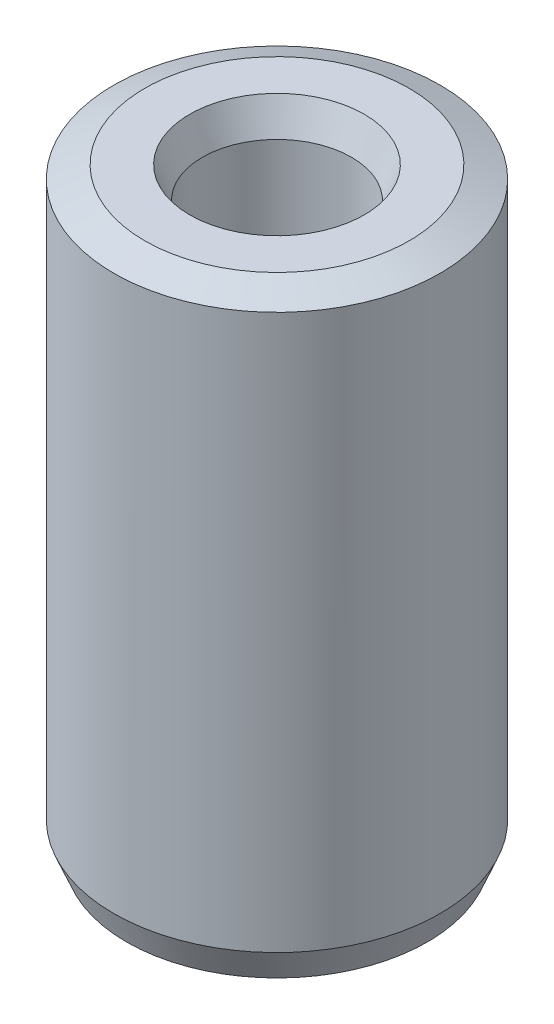
ISO-10303-21;
HEADER;
FILE_DESCRIPTION(('STEP AP214'),'2;1');
FILE_NAME('part.step','',(''),(''),'','','');
FILE_SCHEMA(('AUTOMOTIVE_DESIGN { 1 0 10303 214 1 1 1 1 }'));
ENDSEC;
DATA;
#1=APPLICATION_CONTEXT('core data for automotive mechanical design processes');
#2=APPLICATION_PROTOCOL_DEFINITION('international standard','automotive_design',2000,#1);
#3=PRODUCT_CONTEXT('',#1,'mechanical');
#4=PRODUCT('Part','Part','',(#3));
#5=PRODUCT_RELATED_PRODUCT_CATEGORY('part','',(#4));
#6=PRODUCT_DEFINITION_FORMATION('','',#4);
#7=PRODUCT_DEFINITION_CONTEXT('part definition',#1,'design');
#8=PRODUCT_DEFINITION('design','',#6,#7);
#9=PRODUCT_DEFINITION_SHAPE('','',#8);
#10=(LENGTH_UNIT() NAMED_UNIT(*) SI_UNIT(.MILLI.,.METRE.));
#11=(NAMED_UNIT(*) PLANE_ANGLE_UNIT() SI_UNIT($,.RADIAN.));
#12=(NAMED_UNIT(*) SI_UNIT($,.STERADIAN.) SOLID_ANGLE_UNIT());
#13=UNCERTAINTY_MEASURE_WITH_UNIT(LENGTH_MEASURE(1.E-05),#10,'distance_accuracy_value','');
#14=(GEOMETRIC_REPRESENTATION_CONTEXT(3) GLOBAL_UNCERTAINTY_ASSIGNED_CONTEXT((#13)) GLOBAL_UNIT_ASSIGNED_CONTEXT((#10,
#11,#12)) REPRESENTATION_CONTEXT('',''));
#15=CARTESIAN_POINT('',(0.,0.,0.));
#16=DIRECTION('',(0.,0.,1.));
#17=DIRECTION('',(1.,0.,0.));
#18=AXIS2_PLACEMENT_3D('',#15,#16,#17);
#19=CARTESIAN_POINT('',(0.,183.324099760065,0.));
#20=DIRECTION('',(0.,-1.,0.));
#21=DIRECTION('',(0.,0.,-1.));
#22=AXIS2_PLACEMENT_3D('',#19,#20,#21);
#23=CYLINDRICAL_SURFACE('',#22,50.);
#24=CARTESIAN_POINT('',(0.,9.48601579680206,0.));
#25=DIRECTION('',(0.,1.,0.));
#26=DIRECTION('',(0.,0.,1.));
#27=AXIS2_PLACEMENT_3D('',#24,#25,#26);
#28=CIRCLE('',#27,50.);
#29=CARTESIAN_POINT('',(0.,9.48601579680206,-50.));
#30=VERTEX_POINT('',#29);
#31=EDGE_CURVE('E10',#30,#30,#28,.T.);
#32=CARTESIAN_POINT('',(0.,179.442216912699,0.));
#33=DIRECTION('',(0.,1.,0.));
#34=DIRECTION('',(0.,0.,1.));
#35=AXIS2_PLACEMENT_3D('',#32,#33,#34);
#36=CIRCLE('',#35,50.);
#37=CARTESIAN_POINT('',(0.,179.442216912699,-50.));
#38=VERTEX_POINT('',#37);
#39=EDGE_CURVE('E50',#38,#38,#36,.F.);
#40=CARTESIAN_POINT('',(0.,9.48601579680206,-50.));
#41=CARTESIAN_POINT('',(0.,11.2563928917593,-50.));
#42=CARTESIAN_POINT('',(0.,13.0267699867166,-50.));
#43=CARTESIAN_POINT('',(0.,16.5675241766311,-50.));
#44=CARTESIAN_POINT('',(0.,18.3379012715884,-50.));
#45=CARTESIAN_POINT('',(0.,21.8786554615029,-50.));
#46=CARTESIAN_POINT('',(0.,23.6490325564601,-50.));
#47=CARTESIAN_POINT('',(0.,27.1897867463747,-50.));
#48=CARTESIAN_POINT('',(0.,28.9601638413319,-50.));
#49=CARTESIAN_POINT('',(0.,32.5009180312464,-50.));
#50=CARTESIAN_POINT('',(0.,34.2712951262037,-50.));
#51=CARTESIAN_POINT('',(0.,37.8120493161182,-50.));
#52=CARTESIAN_POINT('',(0.,39.5824264110755,-50.));
#53=CARTESIAN_POINT('',(0.,43.12318060099,-50.));
#54=CARTESIAN_POINT('',(0.,44.8935576959473,-50.));
#55=CARTESIAN_POINT('',(0.,48.4343118858618,-50.));
#56=CARTESIAN_POINT('',(0.,50.2046889808191,-50.));
#57=CARTESIAN_POINT('',(0.,53.7454431707336,-50.));
#58=CARTESIAN_POINT('',(0.,55.5158202656908,-50.));
#59=CARTESIAN_POINT('',(0.,59.0565744556054,-50.));
#60=CARTESIAN_POINT('',(0.,60.8269515505626,-50.));
#61=CARTESIAN_POINT('',(0.,64.3677057404771,-50.));
#62=CARTESIAN_POINT('',(0.,66.1380828354344,-50.));
#63=CARTESIAN_POINT('',(0.,69.6788370253489,-50.));
#64=CARTESIAN_POINT('',(0.,71.4492141203062,-50.));
#65=CARTESIAN_POINT('',(0.,74.9899683102207,-50.));
#66=CARTESIAN_POINT('',(0.,76.760345405178,-50.));
#67=CARTESIAN_POINT('',(0.,80.3010995950925,-50.));
#68=CARTESIAN_POINT('',(0.,82.0714766900498,-50.));
#69=CARTESIAN_POINT('',(0.,85.6122308799643,-50.));
#70=CARTESIAN_POINT('',(0.,87.3826079749215,-50.));
#71=CARTESIAN_POINT('',(0.,90.9233621648361,-50.));
#72=CARTESIAN_POINT('',(0.,92.6937392597933,-50.));
#73=CARTESIAN_POINT('',(0.,96.2344934497079,-50.));
#74=CARTESIAN_POINT('',(0.,98.0048705446651,-50.));
#75=CARTESIAN_POINT('',(0.,101.54562473458,-50.));
#76=CARTESIAN_POINT('',(0.,103.316001829537,-50.));
#77=CARTESIAN_POINT('',(0.,106.856756019451,-50.));
#78=CARTESIAN_POINT('',(0.,108.627133114409,-50.));
#79=CARTESIAN_POINT('',(0.,112.167887304323,-50.));
#80=CARTESIAN_POINT('',(0.,113.93826439928,-50.));
#81=CARTESIAN_POINT('',(0.,117.479018589195,-50.));
#82=CARTESIAN_POINT('',(0.,119.249395684152,-50.));
#83=CARTESIAN_POINT('',(0.,122.790149874067,-50.));
#84=CARTESIAN_POINT('',(0.,124.560526969024,-50.));
#85=CARTESIAN_POINT('',(0.,128.101281158939,-50.));
#86=CARTESIAN_POINT('',(0.,129.871658253896,-50.));
#87=CARTESIAN_POINT('',(0.,133.41241244381,-50.));
#88=CARTESIAN_POINT('',(0.,135.182789538768,-50.));
#89=CARTESIAN_POINT('',(0.,138.723543728682,-50.));
#90=CARTESIAN_POINT('',(0.,140.493920823639,-50.));
#91=CARTESIAN_POINT('',(0.,144.034675013554,-50.));
#92=CARTESIAN_POINT('',(0.,145.805052108511,-50.));
#93=CARTESIAN_POINT('',(0.,149.345806298426,-50.));
#94=CARTESIAN_POINT('',(0.,151.116183393383,-50.));
#95=CARTESIAN_POINT('',(0.,154.656937583297,-50.));
#96=CARTESIAN_POINT('',(0.,156.427314678255,-50.));
#97=CARTESIAN_POINT('',(0.,159.968068868169,-50.));
#98=CARTESIAN_POINT('',(0.,161.738445963127,-50.));
#99=CARTESIAN_POINT('',(0.,165.279200153041,-50.));
#100=CARTESIAN_POINT('',(0.,167.049577247998,-50.));
#101=CARTESIAN_POINT('',(0.,170.590331437913,-50.));
#102=CARTESIAN_POINT('',(0.,172.36070853287,-50.));
#103=CARTESIAN_POINT('',(0.,175.901462722785,-50.));
#104=CARTESIAN_POINT('',(0.,177.671839817742,-50.));
#105=CARTESIAN_POINT('',(0.,179.442216912699,-50.));
#106=B_SPLINE_CURVE_WITH_KNOTS('',3,(#40,#41,#42,#43,#44,#45,#46,#47,#48,#49,#50,#51,#52,#53,
#54,#55,#56,#57,#58,#59,#60,#61,#62,#63,#64,#65,#66,#67,#68,#69,#70,#71,#72,#73,#74,#75,#76,#77,
#78,#79,#80,#81,#82,#83,#84,#85,#86,#87,#88,#89,#90,#91,#92,#93,#94,#95,#96,#97,#98,#99,#100,
#101,#102,#103,#104,#105),.UNSPECIFIED.,.F.,.F.,(4,2,2,2,2,2,2,2,2,2,2,2,2,2,2,2,2,2,2,2,2,2,2,
2,2,2,2,2,2,2,2,2,4),(0.,5.31113128487179,10.6222625697436,15.9333938546153,21.2445251394871,
26.5556564243589,31.8667877092307,37.1779189941025,42.4890502789743,47.8001815638461,
53.1113128487178,58.4224441335896,63.7335754184614,69.0447067033332,74.355837988205,
79.6669692730767,84.9781005579485,90.2892318428203,95.6003631276921,100.911494412564,
106.222625697436,111.533756982307,116.844888267179,122.156019552051,127.467150836923,
132.778282121795,138.089413406666,143.400544691538,148.71167597641,154.022807261282,
159.333938546153,164.645069831025,169.956201115897),.UNSPECIFIED.);
#107=EDGE_CURVE('BSEAM39',#30,#38,#106,.T.);
#108=ORIENTED_EDGE('',*,*,#31,.T.);
#109=ORIENTED_EDGE('',*,*,#39,.T.);
#110=ORIENTED_EDGE('',*,*,#107,.T.);
#111=ORIENTED_EDGE('',*,*,#107,.F.);
#112=EDGE_LOOP('',(#108,#110,#109,#111));
#113=FACE_BOUND('',#112,.T.);
#114=ADVANCED_FACE('F39',(#113),#23,.T.);
#115=CARTESIAN_POINT('',(0.,183.324099760065,0.));
#116=DIRECTION('',(0.,1.,0.));
#117=DIRECTION('',(0.,0.,1.));
#118=AXIS2_PLACEMENT_3D('',#115,#116,#117);
#119=PLANE('',#118);
#120=CARTESIAN_POINT('',(0.,183.324099760065,0.));
#121=DIRECTION('',(0.,1.,0.));
#122=DIRECTION('',(0.,0.,1.));
#123=AXIS2_PLACEMENT_3D('',#120,#121,#122);
#124=CIRCLE('',#123,26.7447267828788);
#125=CARTESIAN_POINT('',(0.,183.324099760065,26.7447267828788));
#126=VERTEX_POINT('',#125);
#127=EDGE_CURVE('E58',#126,#126,#124,.F.);
#128=ORIENTED_EDGE('',*,*,#127,.T.);
#129=EDGE_LOOP('',(#128));
#130=FACE_BOUND('',#129,.T.);
#131=CARTESIAN_POINT('',(0.,183.324099760065,0.));
#132=DIRECTION('',(0.,1.,0.));
#133=DIRECTION('',(0.,0.,1.));
#134=AXIS2_PLACEMENT_3D('',#131,#132,#133);
#135=CIRCLE('',#134,40.5139842031986);
#136=CARTESIAN_POINT('',(0.,183.324099760065,-40.5139842031987));
#137=VERTEX_POINT('',#136);
#138=EDGE_CURVE('E61',#137,#137,#135,.T.);
#139=ORIENTED_EDGE('',*,*,#138,.T.);
#140=EDGE_LOOP('',(#139));
#141=FACE_BOUND('',#140,.T.);
#142=ADVANCED_FACE('F88',(#130,#141),#119,.T.);
#143=CARTESIAN_POINT('',(0.,0.,0.));
#144=DIRECTION('',(0.,1.,0.));
#145=DIRECTION('',(0.,0.,1.));
#146=AXIS2_PLACEMENT_3D('',#143,#144,#145);
#147=PLANE('',#146);
#148=CARTESIAN_POINT('',(0.,0.,0.));
#149=DIRECTION('',(0.,1.,0.));
#150=DIRECTION('',(0.,0.,1.));
#151=AXIS2_PLACEMENT_3D('',#148,#149,#150);
#152=CIRCLE('',#151,32.3488597323145);
#153=CARTESIAN_POINT('',(0.,0.,32.3488597323145));
#154=VERTEX_POINT('',#153);
#155=EDGE_CURVE('E51',#154,#154,#152,.T.);
#156=ORIENTED_EDGE('',*,*,#155,.T.);
#157=EDGE_LOOP('',(#156));
#158=FACE_BOUND('',#157,.T.);
#159=CARTESIAN_POINT('',(0.,0.,0.));
#160=DIRECTION('',(0.,1.,0.));
#161=DIRECTION('',(0.,0.,1.));
#162=AXIS2_PLACEMENT_3D('',#159,#160,#161);
#163=CIRCLE('',#162,46.1181171526343);
#164=CARTESIAN_POINT('',(0.,0.,46.1181171526343));
#165=VERTEX_POINT('',#164);
#166=EDGE_CURVE('E54',#165,#165,#163,.F.);
#167=ORIENTED_EDGE('',*,*,#166,.T.);
#168=EDGE_LOOP('',(#167));
#169=FACE_BOUND('',#168,.T.);
#170=ADVANCED_FACE('F83',(#158,#169),#147,.F.);
#171=CARTESIAN_POINT('',(0.,183.324099760065,0.));
#172=DIRECTION('',(0.,-1.,0.));
#173=DIRECTION('',(0.,0.,-1.));
#174=AXIS2_PLACEMENT_3D('',#171,#172,#173);
#175=CYLINDRICAL_SURFACE('',#174,22.8628439355132);
#176=CARTESIAN_POINT('',(0.,173.838083963263,0.));
#177=DIRECTION('',(0.,1.,0.));
#178=DIRECTION('',(0.,0.,1.));
#179=AXIS2_PLACEMENT_3D('',#176,#177,#178);
#180=CIRCLE('',#179,22.8628439355132);
#181=CARTESIAN_POINT('',(0.,173.838083963263,-22.8628439355132));
#182=VERTEX_POINT('',#181);
#183=EDGE_CURVE('E67',#182,#182,#180,.T.);
#184=CARTESIAN_POINT('',(0.,3.8818828473654,0.));
#185=DIRECTION('',(0.,1.,0.));
#186=DIRECTION('',(0.,0.,1.));
#187=AXIS2_PLACEMENT_3D('',#184,#185,#186);
#188=CIRCLE('',#187,22.8628439355132);
#189=CARTESIAN_POINT('',(0.,3.88188284736538,-22.8628439355132));
#190=VERTEX_POINT('',#189);
#191=EDGE_CURVE('E69',#190,#190,#188,.F.);
#192=CARTESIAN_POINT('',(0.,173.838083963263,-22.8628439355132));
#193=CARTESIAN_POINT('',(0.,172.067706868306,-22.8628439355132));
#194=CARTESIAN_POINT('',(0.,170.297329773348,-22.8628439355132));
#195=CARTESIAN_POINT('',(0.,166.756575583434,-22.8628439355132));
#196=CARTESIAN_POINT('',(0.,164.986198488477,-22.8628439355132));
#197=CARTESIAN_POINT('',(0.,161.445444298562,-22.8628439355132));
#198=CARTESIAN_POINT('',(0.,159.675067203605,-22.8628439355132));
#199=CARTESIAN_POINT('',(0.,156.13431301369,-22.8628439355132));
#200=CARTESIAN_POINT('',(0.,154.363935918733,-22.8628439355132));
#201=CARTESIAN_POINT('',(0.,150.823181728818,-22.8628439355132));
#202=CARTESIAN_POINT('',(0.,149.052804633861,-22.8628439355132));
#203=CARTESIAN_POINT('',(0.,145.512050443947,-22.8628439355132));
#204=CARTESIAN_POINT('',(0.,143.741673348989,-22.8628439355132));
#205=CARTESIAN_POINT('',(0.,140.200919159075,-22.8628439355132));
#206=CARTESIAN_POINT('',(0.,138.430542064118,-22.8628439355132));
#207=CARTESIAN_POINT('',(0.,134.889787874203,-22.8628439355132));
#208=CARTESIAN_POINT('',(0.,133.119410779246,-22.8628439355132));
#209=CARTESIAN_POINT('',(0.,129.578656589331,-22.8628439355132));
#210=CARTESIAN_POINT('',(0.,127.808279494374,-22.8628439355132));
#211=CARTESIAN_POINT('',(0.,124.267525304459,-22.8628439355132));
#212=CARTESIAN_POINT('',(0.,122.497148209502,-22.8628439355132));
#213=CARTESIAN_POINT('',(0.,118.956394019588,-22.8628439355132));
#214=CARTESIAN_POINT('',(0.,117.18601692463,-22.8628439355132));
#215=CARTESIAN_POINT('',(0.,113.645262734716,-22.8628439355132));
#216=CARTESIAN_POINT('',(0.,111.874885639759,-22.8628439355132));
#217=CARTESIAN_POINT('',(0.,108.334131449844,-22.8628439355132));
#218=CARTESIAN_POINT('',(0.,106.563754354887,-22.8628439355132));
#219=CARTESIAN_POINT('',(0.,103.023000164972,-22.8628439355132));
#220=CARTESIAN_POINT('',(0.,101.252623070015,-22.8628439355132));
#221=CARTESIAN_POINT('',(0.,97.7118688801004,-22.8628439355132));
#222=CARTESIAN_POINT('',(0.,95.9414917851432,-22.8628439355132));
#223=CARTESIAN_POINT('',(0.,92.4007375952286,-22.8628439355132));
#224=CARTESIAN_POINT('',(0.,90.6303605002714,-22.8628439355132));
#225=CARTESIAN_POINT('',(0.,87.0896063103569,-22.8628439355132));
#226=CARTESIAN_POINT('',(0.,85.3192292153996,-22.8628439355132));
#227=CARTESIAN_POINT('',(0.,81.7784750254851,-22.8628439355132));
#228=CARTESIAN_POINT('',(0.,80.0080979305278,-22.8628439355132));
#229=CARTESIAN_POINT('',(0.,76.4673437406133,-22.8628439355132));
#230=CARTESIAN_POINT('',(0.,74.696966645656,-22.8628439355132));
#231=CARTESIAN_POINT('',(0.,71.1562124557415,-22.8628439355132));
#232=CARTESIAN_POINT('',(0.,69.3858353607842,-22.8628439355132));
#233=CARTESIAN_POINT('',(0.,65.8450811708697,-22.8628439355132));
#234=CARTESIAN_POINT('',(0.,64.0747040759124,-22.8628439355132));
#235=CARTESIAN_POINT('',(0.,60.5339498859979,-22.8628439355132));
#236=CARTESIAN_POINT('',(0.,58.7635727910406,-22.8628439355132));
#237=CARTESIAN_POINT('',(0.,55.2228186011261,-22.8628439355132));
#238=CARTESIAN_POINT('',(0.,53.4524415061688,-22.8628439355132));
#239=CARTESIAN_POINT('',(0.,49.9116873162543,-22.8628439355132));
#240=CARTESIAN_POINT('',(0.,48.141310221297,-22.8628439355132));
#241=CARTESIAN_POINT('',(0.,44.6005560313825,-22.8628439355132));
#242=CARTESIAN_POINT('',(0.,42.8301789364252,-22.8628439355132));
#243=CARTESIAN_POINT('',(0.,39.2894247465107,-22.8628439355132));
#244=CARTESIAN_POINT('',(0.,37.5190476515534,-22.8628439355132));
#245=CARTESIAN_POINT('',(0.,33.9782934616389,-22.8628439355132));
#246=CARTESIAN_POINT('',(0.,32.2079163666816,-22.8628439355132));
#247=CARTESIAN_POINT('',(0.,28.6671621767671,-22.8628439355132));
#248=CARTESIAN_POINT('',(0.,26.8967850818098,-22.8628439355132));
#249=CARTESIAN_POINT('',(0.,23.3560308918953,-22.8628439355132));
#250=CARTESIAN_POINT('',(0.,21.585653796938,-22.8628439355132));
#251=CARTESIAN_POINT('',(0.,18.0448996070235,-22.8628439355132));
#252=CARTESIAN_POINT('',(0.,16.2745225120662,-22.8628439355132));
#253=CARTESIAN_POINT('',(0.,12.7337683221517,-22.8628439355132));
#254=CARTESIAN_POINT('',(0.,10.9633912271944,-22.8628439355132));
#255=CARTESIAN_POINT('',(0.,7.42263703727992,-22.8628439355132));
#256=CARTESIAN_POINT('',(0.,5.65225994232265,-22.8628439355132));
#257=CARTESIAN_POINT('',(0.,3.88188284736538,-22.8628439355132));
#258=B_SPLINE_CURVE_WITH_KNOTS('',3,(#192,#193,#194,#195,#196,#197,#198,#199,#200,#201,#202,
#203,#204,#205,#206,#207,#208,#209,#210,#211,#212,#213,#214,#215,#216,#217,#218,#219,#220,#221,
#222,#223,#224,#225,#226,#227,#228,#229,#230,#231,#232,#233,#234,#235,#236,#237,#238,#239,#240,
#241,#242,#243,#244,#245,#246,#247,#248,#249,#250,#251,#252,#253,#254,#255,#256,#257),
.UNSPECIFIED.,.F.,.F.,(4,2,2,2,2,2,2,2,2,2,2,2,2,2,2,2,2,2,2,2,2,2,2,2,2,2,2,2,2,2,2,2,4),(0.,
5.31113128487182,10.6222625697436,15.9333938546154,21.2445251394872,26.555656424359,
31.8667877092308,37.1779189941026,42.4890502789744,47.8001815638462,53.111312848718,
58.4224441335898,63.7335754184616,69.0447067033333,74.3558379882052,79.666969273077,
84.9781005579487,90.2892318428205,95.6003631276923,100.911494412564,106.222625697436,
111.533756982308,116.84488826718,122.156019552051,127.467150836923,132.778282121795,
138.089413406667,143.400544691538,148.71167597641,154.022807261282,159.333938546154,
164.645069831026,169.956201115897),.UNSPECIFIED.);
#259=EDGE_CURVE('BSEAM71',#182,#190,#258,.T.);
#260=ORIENTED_EDGE('',*,*,#183,.T.);
#261=ORIENTED_EDGE('',*,*,#191,.T.);
#262=ORIENTED_EDGE('',*,*,#259,.T.);
#263=ORIENTED_EDGE('',*,*,#259,.F.);
#264=EDGE_LOOP('',(#260,#262,#261,#263));
#265=FACE_BOUND('',#264,.T.);
#266=ADVANCED_FACE('F71',(#265),#175,.F.);
#267=CARTESIAN_POINT('',(0.,173.838083963263,0.));
#268=DIRECTION('',(0.,1.,0.));
#269=DIRECTION('',(0.,0.,1.));
#270=AXIS2_PLACEMENT_3D('',#267,#268,#269);
#271=CONICAL_SURFACE('',#270,22.8628439355132,0.388430693503342);
#272=ORIENTED_EDGE('',*,*,#127,.F.);
#273=EDGE_LOOP('',(#272));
#274=FACE_BOUND('',#273,.T.);
#275=ORIENTED_EDGE('',*,*,#183,.F.);
#276=EDGE_LOOP('',(#275));
#277=FACE_BOUND('',#276,.T.);
#278=ADVANCED_FACE('F77',(#274,#277),#271,.F.);
#279=CARTESIAN_POINT('',(0.,0.,0.));
#280=DIRECTION('',(0.,-1.,0.));
#281=DIRECTION('',(0.,0.,-1.));
#282=AXIS2_PLACEMENT_3D('',#279,#280,#281);
#283=CONICAL_SURFACE('',#282,32.3488597323145,1.18236563329155);
#284=ORIENTED_EDGE('',*,*,#191,.F.);
#285=EDGE_LOOP('',(#284));
#286=FACE_BOUND('',#285,.T.);
#287=ORIENTED_EDGE('',*,*,#155,.F.);
#288=EDGE_LOOP('',(#287));
#289=FACE_BOUND('',#288,.T.);
#290=ADVANCED_FACE('F73',(#286,#289),#283,.F.);
#291=CARTESIAN_POINT('',(0.,9.48601579680203,0.));
#292=DIRECTION('',(0.,1.,0.));
#293=DIRECTION('',(0.,0.,1.));
#294=AXIS2_PLACEMENT_3D('',#291,#292,#293);
#295=CONICAL_SURFACE('',#294,50.,0.388430693503345);
#296=ORIENTED_EDGE('',*,*,#166,.F.);
#297=EDGE_LOOP('',(#296));
#298=FACE_BOUND('',#297,.T.);
#299=ORIENTED_EDGE('',*,*,#31,.F.);
#300=EDGE_LOOP('',(#299));
#301=FACE_BOUND('',#300,.T.);
#302=ADVANCED_FACE('F76',(#298,#301),#295,.T.);
#303=CARTESIAN_POINT('',(0.,183.324099760065,0.));
#304=DIRECTION('',(0.,-1.,0.));
#305=DIRECTION('',(0.,0.,-1.));
#306=AXIS2_PLACEMENT_3D('',#303,#304,#305);
#307=CONICAL_SURFACE('',#306,40.5139842031986,1.18236563329155);
#308=CARTESIAN_POINT('',(0.,179.442216912699,-50.));
#309=CARTESIAN_POINT('',(0.,179.482653192359,-49.90118733545));
#310=CARTESIAN_POINT('',(0.,179.523089472019,-49.8023746709));
#311=CARTESIAN_POINT('',(0.,179.603962031339,-49.6047493418));
#312=CARTESIAN_POINT('',(0.,179.644398310999,-49.50593667725));
#313=CARTESIAN_POINT('',(0.,179.72527087032,-49.3083113481499));
#314=CARTESIAN_POINT('',(0.,179.76570714998,-49.2094986835999));
#315=CARTESIAN_POINT('',(0.,179.8465797093,-49.0118733544999));
#316=CARTESIAN_POINT('',(0.,179.88701598896,-48.9130606899499));
#317=CARTESIAN_POINT('',(0.,179.96788854828,-48.7154353608499));
#318=CARTESIAN_POINT('',(0.,180.00832482794,-48.6166226962998));
#319=CARTESIAN_POINT('',(0.,180.08919738726,-48.4189973671998));
#320=CARTESIAN_POINT('',(0.,180.12963366692,-48.3201847026498));
#321=CARTESIAN_POINT('',(0.,180.21050622624,-48.1225593735498));
#322=CARTESIAN_POINT('',(0.,180.2509425059,-48.0237467089998));
#323=CARTESIAN_POINT('',(0.,180.33181506522,-47.8261213798997));
#324=CARTESIAN_POINT('',(0.,180.37225134488,-47.7273087153497));
#325=CARTESIAN_POINT('',(0.,180.453123904201,-47.5296833862497));
#326=CARTESIAN_POINT('',(0.,180.493560183861,-47.4308707216997));
#327=CARTESIAN_POINT('',(0.,180.574432743181,-47.2332453925996));
#328=CARTESIAN_POINT('',(0.,180.614869022841,-47.1344327280496));
#329=CARTESIAN_POINT('',(0.,180.695741582161,-46.9368073989496));
#330=CARTESIAN_POINT('',(0.,180.736177861821,-46.8379947343996));
#331=CARTESIAN_POINT('',(0.,180.817050421141,-46.6403694052996));
#332=CARTESIAN_POINT('',(0.,180.857486700801,-46.5415567407495));
#333=CARTESIAN_POINT('',(0.,180.938359260121,-46.3439314116495));
#334=CARTESIAN_POINT('',(0.,180.978795539781,-46.2451187470995));
#335=CARTESIAN_POINT('',(0.,181.059668099101,-46.0474934179995));
#336=CARTESIAN_POINT('',(0.,181.100104378761,-45.9486807534495));
#337=CARTESIAN_POINT('',(0.,181.180976938082,-45.7510554243494));
#338=CARTESIAN_POINT('',(0.,181.221413217742,-45.6522427597994));
#339=CARTESIAN_POINT('',(0.,181.302285777062,-45.4546174306994));
#340=CARTESIAN_POINT('',(0.,181.342722056722,-45.3558047661494));
#341=CARTESIAN_POINT('',(0.,181.423594616042,-45.1581794370493));
#342=CARTESIAN_POINT('',(0.,181.464030895702,-45.0593667724993));
#343=CARTESIAN_POINT('',(0.,181.544903455022,-44.8617414433993));
#344=CARTESIAN_POINT('',(0.,181.585339734682,-44.7629287788493));
#345=CARTESIAN_POINT('',(0.,181.666212294002,-44.5653034497493));
#346=CARTESIAN_POINT('',(0.,181.706648573662,-44.4664907851992));
#347=CARTESIAN_POINT('',(0.,181.787521132982,-44.2688654560992));
#348=CARTESIAN_POINT('',(0.,181.827957412642,-44.1700527915492));
#349=CARTESIAN_POINT('',(0.,181.908829971963,-43.9724274624492));
#350=CARTESIAN_POINT('',(0.,181.949266251623,-43.8736147978992));
#351=CARTESIAN_POINT('',(0.,182.030138810943,-43.6759894687991));
#352=CARTESIAN_POINT('',(0.,182.070575090603,-43.5771768042491));
#353=CARTESIAN_POINT('',(0.,182.151447649923,-43.3795514751491));
#354=CARTESIAN_POINT('',(0.,182.191883929583,-43.2807388105991));
#355=CARTESIAN_POINT('',(0.,182.272756488903,-43.0831134814991));
#356=CARTESIAN_POINT('',(0.,182.313192768563,-42.984300816949));
#357=CARTESIAN_POINT('',(0.,182.394065327883,-42.786675487849));
#358=CARTESIAN_POINT('',(0.,182.434501607543,-42.687862823299));
#359=CARTESIAN_POINT('',(0.,182.515374166863,-42.490237494199));
#360=CARTESIAN_POINT('',(0.,182.555810446524,-42.3914248296489));
#361=CARTESIAN_POINT('',(0.,182.636683005844,-42.1937995005489));
#362=CARTESIAN_POINT('',(0.,182.677119285504,-42.0949868359989));
#363=CARTESIAN_POINT('',(0.,182.757991844824,-41.8973615068989));
#364=CARTESIAN_POINT('',(0.,182.798428124484,-41.7985488423489));
#365=CARTESIAN_POINT('',(0.,182.879300683804,-41.6009235132488));
#366=CARTESIAN_POINT('',(0.,182.919736963464,-41.5021108486988));
#367=CARTESIAN_POINT('',(0.,183.000609522784,-41.3044855195988));
#368=CARTESIAN_POINT('',(0.,183.041045802444,-41.2056728550488));
#369=CARTESIAN_POINT('',(0.,183.121918361764,-41.0080475259487));
#370=CARTESIAN_POINT('',(0.,183.162354641424,-40.9092348613987));
#371=CARTESIAN_POINT('',(0.,183.243227200744,-40.7116095322987));
#372=CARTESIAN_POINT('',(0.,183.283663480405,-40.6127968677487));
#373=CARTESIAN_POINT('',(0.,183.324099760065,-40.5139842031987));
#374=B_SPLINE_CURVE_WITH_KNOTS('',3,(#308,#309,#310,#311,#312,#313,#314,#315,#316,#317,#318,
#319,#320,#321,#322,#323,#324,#325,#326,#327,#328,#329,#330,#331,#332,#333,#334,#335,#336,#337,
#338,#339,#340,#341,#342,#343,#344,#345,#346,#347,#348,#349,#350,#351,#352,#353,#354,#355,#356,
#357,#358,#359,#360,#361,#362,#363,#364,#365,#366,#367,#368,#369,#370,#371,#372,#373),
.UNSPECIFIED.,.F.,.F.,(4,2,2,2,2,2,2,2,2,2,2,2,2,2,2,2,2,2,2,2,2,2,2,2,2,2,2,2,2,2,2,2,4),(0.,
0.320298795648647,0.64059759129731,0.960896386945967,1.28119518259461,1.60149397824327,
1.92179277389193,2.24209156954059,2.56239036518924,2.8826891608379,3.20298795648655,
3.5232867521352,3.84358554778386,4.16388434343252,4.48418313908118,4.80448193472983,
5.12478073037849,5.44507952602715,5.76537832167579,6.08567711732445,6.40597591297311,
6.72627470862177,7.04657350427042,7.36687229991908,7.68717109556773,8.00746989121639,
8.32776868686504,8.6480674825137,8.96836627816236,9.288665073811,9.60896386945967,
9.92926266510832,10.249561460757),.UNSPECIFIED.);
#375=EDGE_CURVE('BSEAM45',#38,#137,#374,.T.);
#376=ORIENTED_EDGE('',*,*,#39,.F.);
#377=ORIENTED_EDGE('',*,*,#138,.F.);
#378=ORIENTED_EDGE('',*,*,#375,.T.);
#379=ORIENTED_EDGE('',*,*,#375,.F.);
#380=EDGE_LOOP('',(#376,#378,#377,#379));
#381=FACE_BOUND('',#380,.T.);
#382=ADVANCED_FACE('F45',(#381),#307,.T.);
#383=CLOSED_SHELL('',(#114,#142,#170,#266,#278,#290,#302,#382));
#384=MANIFOLD_SOLID_BREP('B2',#383);
#385=ADVANCED_BREP_SHAPE_REPRESENTATION('',(#18,#384),#14);
#386=SHAPE_DEFINITION_REPRESENTATION(#9,#385);
ENDSEC;
END-ISO-10303-21;
